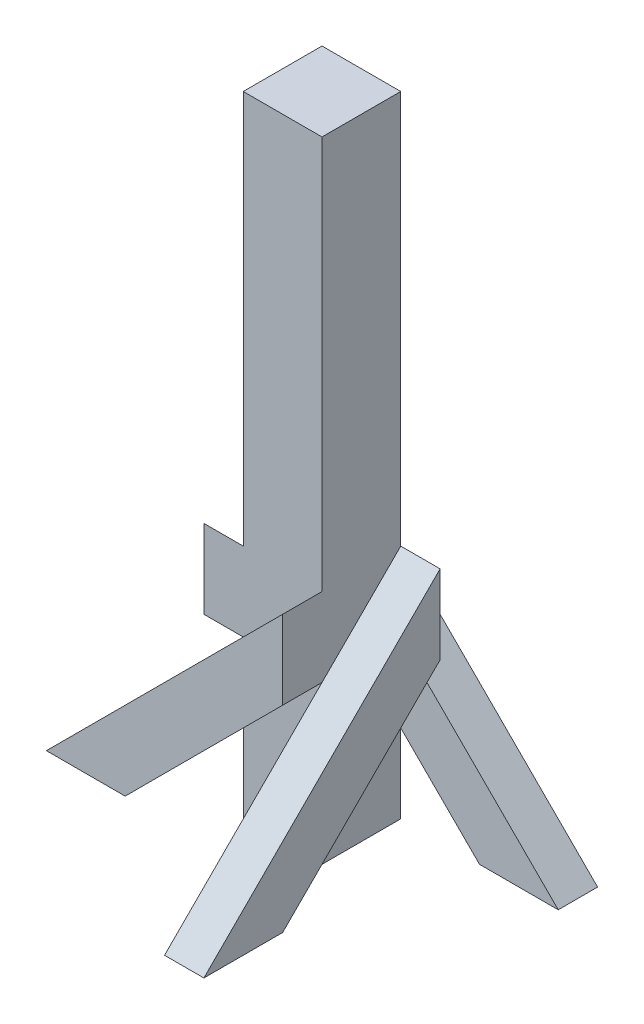
ISO-10303-21;
HEADER;
FILE_DESCRIPTION(('STEP AP214'),'2;1');
FILE_NAME('part.step','',(''),(''),'','','');
FILE_SCHEMA(('AUTOMOTIVE_DESIGN { 1 0 10303 214 1 1 1 1 }'));
ENDSEC;
DATA;
#1=APPLICATION_CONTEXT('core data for automotive mechanical design processes');
#2=APPLICATION_PROTOCOL_DEFINITION('international standard','automotive_design',2000,#1);
#3=PRODUCT_CONTEXT('',#1,'mechanical');
#4=PRODUCT('Part','Part','',(#3));
#5=PRODUCT_RELATED_PRODUCT_CATEGORY('part','',(#4));
#6=PRODUCT_DEFINITION_FORMATION('','',#4);
#7=PRODUCT_DEFINITION_CONTEXT('part definition',#1,'design');
#8=PRODUCT_DEFINITION('design','',#6,#7);
#9=PRODUCT_DEFINITION_SHAPE('','',#8);
#10=(LENGTH_UNIT() NAMED_UNIT(*) SI_UNIT(.MILLI.,.METRE.));
#11=(NAMED_UNIT(*) PLANE_ANGLE_UNIT() SI_UNIT($,.RADIAN.));
#12=(NAMED_UNIT(*) SI_UNIT($,.STERADIAN.) SOLID_ANGLE_UNIT());
#13=UNCERTAINTY_MEASURE_WITH_UNIT(LENGTH_MEASURE(1.E-05),#10,'distance_accuracy_value','');
#14=(GEOMETRIC_REPRESENTATION_CONTEXT(3) GLOBAL_UNCERTAINTY_ASSIGNED_CONTEXT((#13)) GLOBAL_UNIT_ASSIGNED_CONTEXT((#10,
#11,#12)) REPRESENTATION_CONTEXT('',''));
#15=CARTESIAN_POINT('',(0.,0.,0.));
#16=DIRECTION('',(0.,0.,1.));
#17=DIRECTION('',(1.,0.,0.));
#18=AXIS2_PLACEMENT_3D('',#15,#16,#17);
#19=CARTESIAN_POINT('',(43.6880000000002,812.8,-61.976));
#20=DIRECTION('',(1.,0.,0.));
#21=DIRECTION('',(0.,0.,-1.));
#22=AXIS2_PLACEMENT_3D('',#19,#20,#21);
#23=PLANE('',#22);
#24=DIRECTION('',(0.,-1.,0.));
#25=VECTOR('',#24,1.);
#26=CARTESIAN_POINT('',(43.6880000000002,812.8,-61.976));
#27=LINE('',#26,#25);
#28=CARTESIAN_POINT('',(43.6880000000002,203.2,-61.976));
#29=VERTEX_POINT('',#28);
#30=CARTESIAN_POINT('',(43.6880000000003,101.6,-61.976));
#31=VERTEX_POINT('',#30);
#32=EDGE_CURVE('E276',#29,#31,#27,.T.);
#33=ORIENTED_EDGE('',*,*,#32,.F.);
#34=DIRECTION('',(0.,0.707106781186548,-0.707106781186547));
#35=VECTOR('',#34,1.);
#36=CARTESIAN_POINT('',(43.6880000000002,0.,141.224));
#37=LINE('',#36,#35);
#38=CARTESIAN_POINT('',(43.6880000000002,101.6,39.6239999999999));
#39=VERTEX_POINT('',#38);
#40=EDGE_CURVE('E355',#39,#29,#37,.T.);
#41=ORIENTED_EDGE('',*,*,#40,.F.);
#42=DIRECTION('',(0.,-1.,0.));
#43=VECTOR('',#42,1.);
#44=CARTESIAN_POINT('',(43.6880000000002,812.8,39.624));
#45=LINE('',#44,#43);
#46=CARTESIAN_POINT('',(43.6880000000002,0.,39.624));
#47=VERTEX_POINT('',#46);
#48=EDGE_CURVE('E340',#39,#47,#45,.T.);
#49=ORIENTED_EDGE('',*,*,#48,.T.);
#50=DIRECTION('',(0.,0.,1.));
#51=VECTOR('',#50,1.);
#52=CARTESIAN_POINT('',(43.6880000000002,0.,-61.976));
#53=LINE('',#52,#51);
#54=CARTESIAN_POINT('',(43.6880000000002,0.,-61.976));
#55=VERTEX_POINT('',#54);
#56=EDGE_CURVE('E328',#55,#47,#53,.T.);
#57=ORIENTED_EDGE('',*,*,#56,.F.);
#58=DIRECTION('',(0.,-1.,0.));
#59=VECTOR('',#58,1.);
#60=CARTESIAN_POINT('',(43.6880000000002,812.8,-61.976));
#61=LINE('',#60,#59);
#62=EDGE_CURVE('E336',#31,#55,#61,.T.);
#63=ORIENTED_EDGE('',*,*,#62,.F.);
#64=EDGE_LOOP('',(#33,#41,#49,#57,#63));
#65=FACE_BOUND('',#64,.T.);
#66=ADVANCED_FACE('F34',(#65),#23,.T.);
#67=DIRECTION('',(0.,0.,-1.));
#68=VECTOR('',#67,1.);
#69=CARTESIAN_POINT('',(43.6880000000002,203.2,90.424));
#70=LINE('',#69,#68);
#71=CARTESIAN_POINT('',(43.6880000000002,203.2,90.424));
#72=VERTEX_POINT('',#71);
#73=CARTESIAN_POINT('',(43.6880000000002,203.2,39.624));
#74=VERTEX_POINT('',#73);
#75=EDGE_CURVE('E239',#72,#74,#70,.T.);
#76=ORIENTED_EDGE('',*,*,#75,.T.);
#77=DIRECTION('',(0.,-0.707106781186547,0.707106781186547));
#78=VECTOR('',#77,1.);
#79=CARTESIAN_POINT('',(43.6880000000002,0.,242.824));
#80=LINE('',#79,#78);
#81=CARTESIAN_POINT('',(43.6880000000002,304.8,-61.9760000000001));
#82=VERTEX_POINT('',#81);
#83=EDGE_CURVE('E207',#82,#74,#80,.T.);
#84=ORIENTED_EDGE('',*,*,#83,.F.);
#85=CARTESIAN_POINT('',(43.6880000000002,812.8,-61.976));
#86=VERTEX_POINT('',#85);
#87=EDGE_CURVE('E338',#86,#82,#61,.T.);
#88=ORIENTED_EDGE('',*,*,#87,.F.);
#89=DIRECTION('',(0.,0.,1.));
#90=VECTOR('',#89,1.);
#91=CARTESIAN_POINT('',(43.6880000000002,812.8,-61.976));
#92=LINE('',#91,#90);
#93=CARTESIAN_POINT('',(43.6880000000002,812.8,39.624));
#94=VERTEX_POINT('',#93);
#95=EDGE_CURVE('E316',#86,#94,#92,.T.);
#96=ORIENTED_EDGE('',*,*,#95,.T.);
#97=CARTESIAN_POINT('',(43.688,304.8,39.624));
#98=VERTEX_POINT('',#97);
#99=EDGE_CURVE('E341',#94,#98,#45,.T.);
#100=ORIENTED_EDGE('',*,*,#99,.T.);
#101=DIRECTION('',(0.,0.,-1.));
#102=VECTOR('',#101,1.);
#103=CARTESIAN_POINT('',(43.6880000000002,304.8,90.424));
#104=LINE('',#103,#102);
#105=CARTESIAN_POINT('',(43.6880000000002,304.8,90.424));
#106=VERTEX_POINT('',#105);
#107=EDGE_CURVE('E236',#106,#98,#104,.T.);
#108=ORIENTED_EDGE('',*,*,#107,.F.);
#109=DIRECTION('',(0.,1.,0.));
#110=VECTOR('',#109,1.);
#111=CARTESIAN_POINT('',(43.6880000000002,304.8,90.424));
#112=LINE('',#111,#110);
#113=EDGE_CURVE('E225',#72,#106,#112,.T.);
#114=ORIENTED_EDGE('',*,*,#113,.F.);
#115=EDGE_LOOP('',(#76,#84,#88,#96,#100,#108,#114));
#116=FACE_BOUND('',#115,.T.);
#117=ADVANCED_FACE('F396',(#116),#23,.T.);
#118=CARTESIAN_POINT('',(-57.9119999999998,812.8,39.624));
#119=DIRECTION('',(0.,0.,-1.));
#120=DIRECTION('',(-1.,0.,0.));
#121=AXIS2_PLACEMENT_3D('',#118,#119,#120);
#122=PLANE('',#121);
#123=DIRECTION('',(-0.707106781186547,-0.707106781186547,0.));
#124=VECTOR('',#123,1.);
#125=CARTESIAN_POINT('',(-261.112,0.,39.624));
#126=LINE('',#125,#124);
#127=CARTESIAN_POINT('',(-57.9119999999998,203.2,39.6240000000001));
#128=VERTEX_POINT('',#127);
#129=EDGE_CURVE('E223',#98,#128,#126,.T.);
#130=ORIENTED_EDGE('',*,*,#129,.F.);
#131=ORIENTED_EDGE('',*,*,#99,.F.);
#132=DIRECTION('',(1.,0.,0.));
#133=VECTOR('',#132,1.);
#134=CARTESIAN_POINT('',(-57.9119999999998,812.8,39.624));
#135=LINE('',#134,#133);
#136=CARTESIAN_POINT('',(-57.9119999999998,812.8,39.624));
#137=VERTEX_POINT('',#136);
#138=EDGE_CURVE('E313',#137,#94,#135,.T.);
#139=ORIENTED_EDGE('',*,*,#138,.F.);
#140=DIRECTION('',(0.,-1.,0.));
#141=VECTOR('',#140,1.);
#142=CARTESIAN_POINT('',(-57.9119999999998,812.8,39.624));
#143=LINE('',#142,#141);
#144=CARTESIAN_POINT('',(-57.9119999999998,304.799999999999,39.6239999999998));
#145=VERTEX_POINT('',#144);
#146=EDGE_CURVE('E38',#137,#145,#143,.T.);
#147=ORIENTED_EDGE('',*,*,#146,.T.);
#148=DIRECTION('',(1.,0.,0.));
#149=VECTOR('',#148,1.);
#150=CARTESIAN_POINT('',(-108.712,304.8,39.6240000000001));
#151=LINE('',#150,#149);
#152=CARTESIAN_POINT('',(-108.712,304.8,39.6240000000001));
#153=VERTEX_POINT('',#152);
#154=EDGE_CURVE('E300',#153,#145,#151,.T.);
#155=ORIENTED_EDGE('',*,*,#154,.F.);
#156=DIRECTION('',(0.,1.,0.));
#157=VECTOR('',#156,1.);
#158=CARTESIAN_POINT('',(-108.712,304.8,39.6240000000001));
#159=LINE('',#158,#157);
#160=CARTESIAN_POINT('',(-108.712,203.2,39.6240000000001));
#161=VERTEX_POINT('',#160);
#162=EDGE_CURVE('E285',#161,#153,#159,.T.);
#163=ORIENTED_EDGE('',*,*,#162,.F.);
#164=DIRECTION('',(1.,0.,0.));
#165=VECTOR('',#164,1.);
#166=CARTESIAN_POINT('',(-108.712,203.2,39.6240000000001));
#167=LINE('',#166,#165);
#168=EDGE_CURVE('E303',#161,#128,#167,.T.);
#169=ORIENTED_EDGE('',*,*,#168,.T.);
#170=EDGE_LOOP('',(#130,#131,#139,#147,#155,#163,#169));
#171=FACE_BOUND('',#170,.T.);
#172=ADVANCED_FACE('F426',(#171),#122,.F.);
#173=DIRECTION('',(0.707106781186547,0.707106781186547,0.));
#174=VECTOR('',#173,1.);
#175=CARTESIAN_POINT('',(-159.512,0.,39.624));
#176=LINE('',#175,#174);
#177=CARTESIAN_POINT('',(-57.9119999999999,101.6,39.624));
#178=VERTEX_POINT('',#177);
#179=EDGE_CURVE('E11',#178,#74,#176,.T.);
#180=ORIENTED_EDGE('',*,*,#179,.F.);
#181=CARTESIAN_POINT('',(-57.9119999999998,0.,39.624));
#182=VERTEX_POINT('',#181);
#183=EDGE_CURVE('E343',#178,#182,#143,.T.);
#184=ORIENTED_EDGE('',*,*,#183,.T.);
#185=DIRECTION('',(1.,0.,0.));
#186=VECTOR('',#185,1.);
#187=CARTESIAN_POINT('',(-57.9119999999998,0.,39.624));
#188=LINE('',#187,#186);
#189=EDGE_CURVE('E325',#182,#47,#188,.T.);
#190=ORIENTED_EDGE('',*,*,#189,.T.);
#191=ORIENTED_EDGE('',*,*,#48,.F.);
#192=EDGE_CURVE('E344',#74,#39,#45,.T.);
#193=ORIENTED_EDGE('',*,*,#192,.F.);
#194=EDGE_LOOP('',(#180,#184,#190,#191,#193));
#195=FACE_BOUND('',#194,.T.);
#196=ADVANCED_FACE('F357',(#195),#122,.F.);
#197=CARTESIAN_POINT('',(-57.9119999999998,812.8,-61.976));
#198=DIRECTION('',(0.,0.,-1.));
#199=DIRECTION('',(-1.,0.,0.));
#200=AXIS2_PLACEMENT_3D('',#197,#198,#199);
#201=PLANE('',#200);
#202=DIRECTION('',(0.,-1.,0.));
#203=VECTOR('',#202,1.);
#204=CARTESIAN_POINT('',(-57.9119999999998,812.8,-61.976));
#205=LINE('',#204,#203);
#206=CARTESIAN_POINT('',(-57.9119999999998,203.2,-61.976));
#207=VERTEX_POINT('',#206);
#208=CARTESIAN_POINT('',(-57.9119999999998,101.6,-61.9760000000001));
#209=VERTEX_POINT('',#208);
#210=EDGE_CURVE('E337',#207,#209,#205,.T.);
#211=ORIENTED_EDGE('',*,*,#210,.F.);
#212=DIRECTION('',(-0.707106781186547,0.707106781186548,0.));
#213=VECTOR('',#212,1.);
#214=CARTESIAN_POINT('',(145.288,0.,-61.976));
#215=LINE('',#214,#213);
#216=EDGE_CURVE('E259',#31,#207,#215,.T.);
#217=ORIENTED_EDGE('',*,*,#216,.F.);
#218=ORIENTED_EDGE('',*,*,#62,.T.);
#219=DIRECTION('',(1.,0.,0.));
#220=VECTOR('',#219,1.);
#221=CARTESIAN_POINT('',(-57.9119999999998,0.,-61.976));
#222=LINE('',#221,#220);
#223=CARTESIAN_POINT('',(-57.9119999999998,0.,-61.976));
#224=VERTEX_POINT('',#223);
#225=EDGE_CURVE('E314',#224,#55,#222,.T.);
#226=ORIENTED_EDGE('',*,*,#225,.F.);
#227=EDGE_CURVE('E322',#209,#224,#205,.T.);
#228=ORIENTED_EDGE('',*,*,#227,.F.);
#229=EDGE_LOOP('',(#211,#217,#218,#226,#228));
#230=FACE_BOUND('',#229,.T.);
#231=ADVANCED_FACE('F365',(#230),#201,.T.);
#232=ORIENTED_EDGE('',*,*,#87,.T.);
#233=DIRECTION('',(-1.,0.,0.));
#234=VECTOR('',#233,1.);
#235=CARTESIAN_POINT('',(94.4880000000002,304.8,-61.976));
#236=LINE('',#235,#234);
#237=CARTESIAN_POINT('',(94.4880000000002,304.8,-61.976));
#238=VERTEX_POINT('',#237);
#239=EDGE_CURVE('E52',#238,#82,#236,.T.);
#240=ORIENTED_EDGE('',*,*,#239,.F.);
#241=DIRECTION('',(0.,1.,0.));
#242=VECTOR('',#241,1.);
#243=CARTESIAN_POINT('',(94.4880000000002,304.8,-61.976));
#244=LINE('',#243,#242);
#245=CARTESIAN_POINT('',(94.4880000000002,203.2,-61.976));
#246=VERTEX_POINT('',#245);
#247=EDGE_CURVE('E198',#246,#238,#244,.T.);
#248=ORIENTED_EDGE('',*,*,#247,.F.);
#249=DIRECTION('',(-1.,0.,0.));
#250=VECTOR('',#249,1.);
#251=CARTESIAN_POINT('',(94.4880000000002,203.2,-61.976));
#252=LINE('',#251,#250);
#253=EDGE_CURVE('E195',#246,#29,#252,.T.);
#254=ORIENTED_EDGE('',*,*,#253,.T.);
#255=DIRECTION('',(0.707106781186547,-0.707106781186547,0.));
#256=VECTOR('',#255,1.);
#257=CARTESIAN_POINT('',(246.888,0.,-61.976));
#258=LINE('',#257,#256);
#259=CARTESIAN_POINT('',(-57.9119999999999,304.8,-61.976));
#260=VERTEX_POINT('',#259);
#261=EDGE_CURVE('E250',#260,#29,#258,.T.);
#262=ORIENTED_EDGE('',*,*,#261,.F.);
#263=CARTESIAN_POINT('',(-57.9119999999998,812.8,-61.976));
#264=VERTEX_POINT('',#263);
#265=EDGE_CURVE('E333',#264,#260,#205,.T.);
#266=ORIENTED_EDGE('',*,*,#265,.F.);
#267=DIRECTION('',(1.,0.,0.));
#268=VECTOR('',#267,1.);
#269=CARTESIAN_POINT('',(-57.9119999999998,812.8,-61.976));
#270=LINE('',#269,#268);
#271=EDGE_CURVE('E319',#264,#86,#270,.T.);
#272=ORIENTED_EDGE('',*,*,#271,.T.);
#273=EDGE_LOOP('',(#232,#240,#248,#254,#262,#266,#272));
#274=FACE_BOUND('',#273,.T.);
#275=ADVANCED_FACE('F386',(#274),#201,.T.);
#276=CARTESIAN_POINT('',(-57.9119999999998,812.8,-61.976));
#277=DIRECTION('',(1.,0.,0.));
#278=DIRECTION('',(0.,0.,-1.));
#279=AXIS2_PLACEMENT_3D('',#276,#277,#278);
#280=PLANE('',#279);
#281=DIRECTION('',(0.,-0.707106781186547,-0.707106781186547));
#282=VECTOR('',#281,1.);
#283=CARTESIAN_POINT('',(-57.9119999999998,0.,-265.176));
#284=LINE('',#283,#282);
#285=EDGE_CURVE('E283',#145,#207,#284,.T.);
#286=ORIENTED_EDGE('',*,*,#285,.F.);
#287=ORIENTED_EDGE('',*,*,#146,.F.);
#288=DIRECTION('',(0.,0.,1.));
#289=VECTOR('',#288,1.);
#290=CARTESIAN_POINT('',(-57.9119999999998,812.8,-61.976));
#291=LINE('',#290,#289);
#292=EDGE_CURVE('E310',#264,#137,#291,.T.);
#293=ORIENTED_EDGE('',*,*,#292,.F.);
#294=ORIENTED_EDGE('',*,*,#265,.T.);
#295=DIRECTION('',(0.,0.,1.));
#296=VECTOR('',#295,1.);
#297=CARTESIAN_POINT('',(-57.9119999999998,304.8,-112.776));
#298=LINE('',#297,#296);
#299=CARTESIAN_POINT('',(-57.9119999999998,304.8,-112.776));
#300=VERTEX_POINT('',#299);
#301=EDGE_CURVE('E268',#300,#260,#298,.T.);
#302=ORIENTED_EDGE('',*,*,#301,.F.);
#303=DIRECTION('',(0.,1.,0.));
#304=VECTOR('',#303,1.);
#305=CARTESIAN_POINT('',(-57.9119999999998,304.8,-112.776));
#306=LINE('',#305,#304);
#307=CARTESIAN_POINT('',(-57.9119999999998,203.2,-112.776));
#308=VERTEX_POINT('',#307);
#309=EDGE_CURVE('E252',#308,#300,#306,.T.);
#310=ORIENTED_EDGE('',*,*,#309,.F.);
#311=DIRECTION('',(0.,0.,1.));
#312=VECTOR('',#311,1.);
#313=CARTESIAN_POINT('',(-57.9119999999998,203.2,-112.776));
#314=LINE('',#313,#312);
#315=EDGE_CURVE('E270',#308,#207,#314,.T.);
#316=ORIENTED_EDGE('',*,*,#315,.T.);
#317=EDGE_LOOP('',(#286,#287,#293,#294,#302,#310,#316));
#318=FACE_BOUND('',#317,.T.);
#319=ADVANCED_FACE('F36',(#318),#280,.F.);
#320=DIRECTION('',(0.,0.707106781186547,0.707106781186547));
#321=VECTOR('',#320,1.);
#322=CARTESIAN_POINT('',(-57.9119999999998,0.,-163.576));
#323=LINE('',#322,#321);
#324=EDGE_CURVE('E43',#209,#128,#323,.T.);
#325=ORIENTED_EDGE('',*,*,#324,.F.);
#326=ORIENTED_EDGE('',*,*,#227,.T.);
#327=DIRECTION('',(0.,0.,1.));
#328=VECTOR('',#327,1.);
#329=CARTESIAN_POINT('',(-57.9119999999998,0.,-61.976));
#330=LINE('',#329,#328);
#331=EDGE_CURVE('E309',#224,#182,#330,.T.);
#332=ORIENTED_EDGE('',*,*,#331,.T.);
#333=ORIENTED_EDGE('',*,*,#183,.F.);
#334=EDGE_CURVE('E348',#128,#178,#143,.T.);
#335=ORIENTED_EDGE('',*,*,#334,.F.);
#336=EDGE_LOOP('',(#325,#326,#332,#333,#335));
#337=FACE_BOUND('',#336,.T.);
#338=ADVANCED_FACE('F439',(#337),#280,.F.);
#339=CARTESIAN_POINT('',(0.,812.8,0.));
#340=DIRECTION('',(0.,1.,0.));
#341=DIRECTION('',(0.,0.,1.));
#342=AXIS2_PLACEMENT_3D('',#339,#340,#341);
#343=PLANE('',#342);
#344=ORIENTED_EDGE('',*,*,#292,.T.);
#345=ORIENTED_EDGE('',*,*,#138,.T.);
#346=ORIENTED_EDGE('',*,*,#95,.F.);
#347=ORIENTED_EDGE('',*,*,#271,.F.);
#348=EDGE_LOOP('',(#344,#345,#346,#347));
#349=FACE_BOUND('',#348,.T.);
#350=ADVANCED_FACE('F395',(#349),#343,.T.);
#351=CARTESIAN_POINT('',(0.,0.,0.));
#352=DIRECTION('',(0.,1.,0.));
#353=DIRECTION('',(0.,0.,1.));
#354=AXIS2_PLACEMENT_3D('',#351,#352,#353);
#355=PLANE('',#354);
#356=ORIENTED_EDGE('',*,*,#331,.F.);
#357=ORIENTED_EDGE('',*,*,#225,.T.);
#358=ORIENTED_EDGE('',*,*,#56,.T.);
#359=ORIENTED_EDGE('',*,*,#189,.F.);
#360=EDGE_LOOP('',(#356,#357,#358,#359));
#361=FACE_BOUND('',#360,.T.);
#362=ADVANCED_FACE('F360',(#361),#355,.F.);
#363=CARTESIAN_POINT('',(-108.712,0.,-265.176));
#364=DIRECTION('',(0.,1.,0.));
#365=DIRECTION('',(0.,0.,1.));
#366=AXIS2_PLACEMENT_3D('',#363,#364,#365);
#367=PLANE('',#366);
#368=DIRECTION('',(0.,0.,1.));
#369=VECTOR('',#368,1.);
#370=CARTESIAN_POINT('',(-57.9119999999998,0.,-265.176));
#371=LINE('',#370,#369);
#372=CARTESIAN_POINT('',(-57.9119999999998,0.,-265.176));
#373=VERTEX_POINT('',#372);
#374=CARTESIAN_POINT('',(-57.9119999999998,0.,-163.576));
#375=VERTEX_POINT('',#374);
#376=EDGE_CURVE('E278',#373,#375,#371,.T.);
#377=ORIENTED_EDGE('',*,*,#376,.T.);
#378=DIRECTION('',(1.,0.,0.));
#379=VECTOR('',#378,1.);
#380=CARTESIAN_POINT('',(-108.712,0.,-163.576));
#381=LINE('',#380,#379);
#382=CARTESIAN_POINT('',(-108.712,0.,-163.576));
#383=VERTEX_POINT('',#382);
#384=EDGE_CURVE('E306',#383,#375,#381,.T.);
#385=ORIENTED_EDGE('',*,*,#384,.F.);
#386=DIRECTION('',(0.,0.,1.));
#387=VECTOR('',#386,1.);
#388=CARTESIAN_POINT('',(-108.712,0.,-265.176));
#389=LINE('',#388,#387);
#390=CARTESIAN_POINT('',(-108.712,0.,-265.176));
#391=VERTEX_POINT('',#390);
#392=EDGE_CURVE('E279',#391,#383,#389,.T.);
#393=ORIENTED_EDGE('',*,*,#392,.F.);
#394=DIRECTION('',(1.,0.,0.));
#395=VECTOR('',#394,1.);
#396=CARTESIAN_POINT('',(-108.712,0.,-265.176));
#397=LINE('',#396,#395);
#398=EDGE_CURVE('E289',#391,#373,#397,.T.);
#399=ORIENTED_EDGE('',*,*,#398,.T.);
#400=EDGE_LOOP('',(#377,#385,#393,#399));
#401=FACE_BOUND('',#400,.T.);
#402=ADVANCED_FACE('F435',(#401),#367,.F.);
#403=CARTESIAN_POINT('',(-108.712,0.,-163.576));
#404=DIRECTION('',(0.,0.707106781186548,-0.707106781186548));
#405=DIRECTION('',(0.,0.707106781186548,0.707106781186548));
#406=AXIS2_PLACEMENT_3D('',#403,#404,#405);
#407=PLANE('',#406);
#408=EDGE_CURVE('E292',#375,#209,#323,.T.);
#409=ORIENTED_EDGE('',*,*,#408,.T.);
#410=ORIENTED_EDGE('',*,*,#324,.T.);
#411=ORIENTED_EDGE('',*,*,#168,.F.);
#412=DIRECTION('',(0.,0.707106781186547,0.707106781186547));
#413=VECTOR('',#412,1.);
#414=CARTESIAN_POINT('',(-108.712,0.,-163.576));
#415=LINE('',#414,#413);
#416=EDGE_CURVE('E282',#383,#161,#415,.T.);
#417=ORIENTED_EDGE('',*,*,#416,.F.);
#418=ORIENTED_EDGE('',*,*,#384,.T.);
#419=EDGE_LOOP('',(#409,#410,#411,#417,#418));
#420=FACE_BOUND('',#419,.T.);
#421=ADVANCED_FACE('F424',(#420),#407,.F.);
#422=CARTESIAN_POINT('',(-108.712,0.,-265.176));
#423=DIRECTION('',(0.,-0.707106781186548,0.707106781186548));
#424=DIRECTION('',(0.,-0.707106781186548,-0.707106781186547));
#425=AXIS2_PLACEMENT_3D('',#422,#423,#424);
#426=PLANE('',#425);
#427=ORIENTED_EDGE('',*,*,#285,.T.);
#428=EDGE_CURVE('E295',#207,#373,#284,.T.);
#429=ORIENTED_EDGE('',*,*,#428,.T.);
#430=ORIENTED_EDGE('',*,*,#398,.F.);
#431=DIRECTION('',(0.,-0.707106781186547,-0.707106781186547));
#432=VECTOR('',#431,1.);
#433=CARTESIAN_POINT('',(-108.712,0.,-265.176));
#434=LINE('',#433,#432);
#435=EDGE_CURVE('E287',#153,#391,#434,.T.);
#436=ORIENTED_EDGE('',*,*,#435,.F.);
#437=ORIENTED_EDGE('',*,*,#154,.T.);
#438=EDGE_LOOP('',(#427,#429,#430,#436,#437));
#439=FACE_BOUND('',#438,.T.);
#440=ADVANCED_FACE('F480',(#439),#426,.F.);
#441=CARTESIAN_POINT('',(-108.712,0.,0.));
#442=DIRECTION('',(1.,0.,0.));
#443=DIRECTION('',(0.,0.,-1.));
#444=AXIS2_PLACEMENT_3D('',#441,#442,#443);
#445=PLANE('',#444);
#446=ORIENTED_EDGE('',*,*,#392,.T.);
#447=ORIENTED_EDGE('',*,*,#416,.T.);
#448=ORIENTED_EDGE('',*,*,#162,.T.);
#449=ORIENTED_EDGE('',*,*,#435,.T.);
#450=EDGE_LOOP('',(#446,#447,#448,#449));
#451=FACE_BOUND('',#450,.T.);
#452=ADVANCED_FACE('F429',(#451),#445,.F.);
#453=CARTESIAN_POINT('',(-57.9119999999998,0.,0.));
#454=DIRECTION('',(1.,0.,0.));
#455=DIRECTION('',(0.,0.,-1.));
#456=AXIS2_PLACEMENT_3D('',#453,#454,#455);
#457=PLANE('',#456);
#458=ORIENTED_EDGE('',*,*,#428,.F.);
#459=ORIENTED_EDGE('',*,*,#210,.T.);
#460=ORIENTED_EDGE('',*,*,#408,.F.);
#461=ORIENTED_EDGE('',*,*,#376,.F.);
#462=EDGE_LOOP('',(#458,#459,#460,#461));
#463=FACE_BOUND('',#462,.T.);
#464=ADVANCED_FACE('F438',(#463),#457,.T.);
#465=CARTESIAN_POINT('',(246.888,0.,-112.776));
#466=DIRECTION('',(0.,1.,0.));
#467=DIRECTION('',(-1.,0.,0.));
#468=AXIS2_PLACEMENT_3D('',#465,#466,#467);
#469=PLANE('',#468);
#470=DIRECTION('',(-1.,0.,0.));
#471=VECTOR('',#470,1.);
#472=CARTESIAN_POINT('',(246.888,0.,-61.976));
#473=LINE('',#472,#471);
#474=CARTESIAN_POINT('',(246.888,0.,-61.976));
#475=VERTEX_POINT('',#474);
#476=CARTESIAN_POINT('',(145.288,0.,-61.976));
#477=VERTEX_POINT('',#476);
#478=EDGE_CURVE('E245',#475,#477,#473,.T.);
#479=ORIENTED_EDGE('',*,*,#478,.T.);
#480=DIRECTION('',(0.,0.,1.));
#481=VECTOR('',#480,1.);
#482=CARTESIAN_POINT('',(145.288,0.,-112.776));
#483=LINE('',#482,#481);
#484=CARTESIAN_POINT('',(145.288,0.,-112.776));
#485=VERTEX_POINT('',#484);
#486=EDGE_CURVE('E273',#485,#477,#483,.T.);
#487=ORIENTED_EDGE('',*,*,#486,.F.);
#488=DIRECTION('',(-1.,0.,0.));
#489=VECTOR('',#488,1.);
#490=CARTESIAN_POINT('',(246.888,0.,-112.776));
#491=LINE('',#490,#489);
#492=CARTESIAN_POINT('',(246.888,0.,-112.776));
#493=VERTEX_POINT('',#492);
#494=EDGE_CURVE('E246',#493,#485,#491,.T.);
#495=ORIENTED_EDGE('',*,*,#494,.F.);
#496=DIRECTION('',(0.,0.,1.));
#497=VECTOR('',#496,1.);
#498=CARTESIAN_POINT('',(246.888,0.,-112.776));
#499=LINE('',#498,#497);
#500=EDGE_CURVE('E256',#493,#475,#499,.T.);
#501=ORIENTED_EDGE('',*,*,#500,.T.);
#502=EDGE_LOOP('',(#479,#487,#495,#501));
#503=FACE_BOUND('',#502,.T.);
#504=ADVANCED_FACE('F378',(#503),#469,.F.);
#505=CARTESIAN_POINT('',(145.288,0.,-112.776));
#506=DIRECTION('',(0.707106781186548,0.707106781186547,0.));
#507=DIRECTION('',(-0.707106781186547,0.707106781186548,0.));
#508=AXIS2_PLACEMENT_3D('',#505,#506,#507);
#509=PLANE('',#508);
#510=EDGE_CURVE('E260',#477,#31,#215,.T.);
#511=ORIENTED_EDGE('',*,*,#510,.T.);
#512=ORIENTED_EDGE('',*,*,#216,.T.);
#513=ORIENTED_EDGE('',*,*,#315,.F.);
#514=DIRECTION('',(-0.707106781186547,0.707106781186548,0.));
#515=VECTOR('',#514,1.);
#516=CARTESIAN_POINT('',(145.288,0.,-112.776));
#517=LINE('',#516,#515);
#518=EDGE_CURVE('E249',#485,#308,#517,.T.);
#519=ORIENTED_EDGE('',*,*,#518,.F.);
#520=ORIENTED_EDGE('',*,*,#486,.T.);
#521=EDGE_LOOP('',(#511,#512,#513,#519,#520));
#522=FACE_BOUND('',#521,.T.);
#523=ADVANCED_FACE('F373',(#522),#509,.F.);
#524=CARTESIAN_POINT('',(246.888,0.,-112.776));
#525=DIRECTION('',(-0.707106781186548,-0.707106781186548,0.));
#526=DIRECTION('',(0.707106781186547,-0.707106781186548,0.));
#527=AXIS2_PLACEMENT_3D('',#524,#525,#526);
#528=PLANE('',#527);
#529=ORIENTED_EDGE('',*,*,#261,.T.);
#530=EDGE_CURVE('E263',#29,#475,#258,.T.);
#531=ORIENTED_EDGE('',*,*,#530,.T.);
#532=ORIENTED_EDGE('',*,*,#500,.F.);
#533=DIRECTION('',(0.707106781186547,-0.707106781186547,0.));
#534=VECTOR('',#533,1.);
#535=CARTESIAN_POINT('',(246.888,0.,-112.776));
#536=LINE('',#535,#534);
#537=EDGE_CURVE('E254',#300,#493,#536,.T.);
#538=ORIENTED_EDGE('',*,*,#537,.F.);
#539=ORIENTED_EDGE('',*,*,#301,.T.);
#540=EDGE_LOOP('',(#529,#531,#532,#538,#539));
#541=FACE_BOUND('',#540,.T.);
#542=ADVANCED_FACE('F382',(#541),#528,.F.);
#543=CARTESIAN_POINT('',(0.,0.,-112.776));
#544=DIRECTION('',(0.,0.,1.));
#545=DIRECTION('',(1.,0.,0.));
#546=AXIS2_PLACEMENT_3D('',#543,#544,#545);
#547=PLANE('',#546);
#548=ORIENTED_EDGE('',*,*,#494,.T.);
#549=ORIENTED_EDGE('',*,*,#518,.T.);
#550=ORIENTED_EDGE('',*,*,#309,.T.);
#551=ORIENTED_EDGE('',*,*,#537,.T.);
#552=EDGE_LOOP('',(#548,#549,#550,#551));
#553=FACE_BOUND('',#552,.T.);
#554=ADVANCED_FACE('F520',(#553),#547,.F.);
#555=CARTESIAN_POINT('',(0.,0.,-61.976));
#556=DIRECTION('',(0.,0.,1.));
#557=DIRECTION('',(1.,0.,0.));
#558=AXIS2_PLACEMENT_3D('',#555,#556,#557);
#559=PLANE('',#558);
#560=ORIENTED_EDGE('',*,*,#530,.F.);
#561=ORIENTED_EDGE('',*,*,#32,.T.);
#562=ORIENTED_EDGE('',*,*,#510,.F.);
#563=ORIENTED_EDGE('',*,*,#478,.F.);
#564=EDGE_LOOP('',(#560,#561,#562,#563));
#565=FACE_BOUND('',#564,.T.);
#566=ADVANCED_FACE('F370',(#565),#559,.T.);
#567=CARTESIAN_POINT('',(-261.112,0.,90.424));
#568=DIRECTION('',(0.,1.,0.));
#569=DIRECTION('',(-1.,0.,0.));
#570=AXIS2_PLACEMENT_3D('',#567,#568,#569);
#571=PLANE('',#570);
#572=DIRECTION('',(1.,0.,0.));
#573=VECTOR('',#572,1.);
#574=CARTESIAN_POINT('',(-261.112,0.,39.624));
#575=LINE('',#574,#573);
#576=CARTESIAN_POINT('',(-261.112,0.,39.624));
#577=VERTEX_POINT('',#576);
#578=CARTESIAN_POINT('',(-159.512,0.,39.624));
#579=VERTEX_POINT('',#578);
#580=EDGE_CURVE('E212',#577,#579,#575,.T.);
#581=ORIENTED_EDGE('',*,*,#580,.T.);
#582=DIRECTION('',(0.,0.,-1.));
#583=VECTOR('',#582,1.);
#584=CARTESIAN_POINT('',(-159.512,0.,90.424));
#585=LINE('',#584,#583);
#586=CARTESIAN_POINT('',(-159.512,0.,90.424));
#587=VERTEX_POINT('',#586);
#588=EDGE_CURVE('E242',#587,#579,#585,.T.);
#589=ORIENTED_EDGE('',*,*,#588,.F.);
#590=DIRECTION('',(1.,0.,0.));
#591=VECTOR('',#590,1.);
#592=CARTESIAN_POINT('',(-261.112,0.,90.424));
#593=LINE('',#592,#591);
#594=CARTESIAN_POINT('',(-261.112,0.,90.424));
#595=VERTEX_POINT('',#594);
#596=EDGE_CURVE('E219',#595,#587,#593,.T.);
#597=ORIENTED_EDGE('',*,*,#596,.F.);
#598=DIRECTION('',(0.,0.,-1.));
#599=VECTOR('',#598,1.);
#600=CARTESIAN_POINT('',(-261.112,0.,90.424));
#601=LINE('',#600,#599);
#602=EDGE_CURVE('E228',#595,#577,#601,.T.);
#603=ORIENTED_EDGE('',*,*,#602,.T.);
#604=EDGE_LOOP('',(#581,#589,#597,#603));
#605=FACE_BOUND('',#604,.T.);
#606=ADVANCED_FACE('F551',(#605),#571,.F.);
#607=CARTESIAN_POINT('',(-159.512,0.,90.424));
#608=DIRECTION('',(-0.707106781186548,0.707106781186548,0.));
#609=DIRECTION('',(-0.707106781186548,-0.707106781186548,0.));
#610=AXIS2_PLACEMENT_3D('',#607,#608,#609);
#611=PLANE('',#610);
#612=EDGE_CURVE('E45',#579,#178,#176,.T.);
#613=ORIENTED_EDGE('',*,*,#612,.T.);
#614=ORIENTED_EDGE('',*,*,#179,.T.);
#615=ORIENTED_EDGE('',*,*,#75,.F.);
#616=DIRECTION('',(0.707106781186547,0.707106781186547,0.));
#617=VECTOR('',#616,1.);
#618=CARTESIAN_POINT('',(-159.512,0.,90.424));
#619=LINE('',#618,#617);
#620=EDGE_CURVE('E222',#587,#72,#619,.T.);
#621=ORIENTED_EDGE('',*,*,#620,.F.);
#622=ORIENTED_EDGE('',*,*,#588,.T.);
#623=EDGE_LOOP('',(#613,#614,#615,#621,#622));
#624=FACE_BOUND('',#623,.T.);
#625=ADVANCED_FACE('F411',(#624),#611,.F.);
#626=CARTESIAN_POINT('',(-261.112,0.,90.424));
#627=DIRECTION('',(0.707106781186548,-0.707106781186548,0.));
#628=DIRECTION('',(0.707106781186547,0.707106781186548,0.));
#629=AXIS2_PLACEMENT_3D('',#626,#627,#628);
#630=PLANE('',#629);
#631=ORIENTED_EDGE('',*,*,#129,.T.);
#632=EDGE_CURVE('E231',#128,#577,#126,.T.);
#633=ORIENTED_EDGE('',*,*,#632,.T.);
#634=ORIENTED_EDGE('',*,*,#602,.F.);
#635=DIRECTION('',(-0.707106781186547,-0.707106781186547,0.));
#636=VECTOR('',#635,1.);
#637=CARTESIAN_POINT('',(-261.112,0.,90.424));
#638=LINE('',#637,#636);
#639=EDGE_CURVE('E227',#106,#595,#638,.T.);
#640=ORIENTED_EDGE('',*,*,#639,.F.);
#641=ORIENTED_EDGE('',*,*,#107,.T.);
#642=EDGE_LOOP('',(#631,#633,#634,#640,#641));
#643=FACE_BOUND('',#642,.T.);
#644=ADVANCED_FACE('F562',(#643),#630,.F.);
#645=CARTESIAN_POINT('',(0.,0.,90.424));
#646=DIRECTION('',(0.,0.,-1.));
#647=DIRECTION('',(-1.,0.,0.));
#648=AXIS2_PLACEMENT_3D('',#645,#646,#647);
#649=PLANE('',#648);
#650=ORIENTED_EDGE('',*,*,#596,.T.);
#651=ORIENTED_EDGE('',*,*,#620,.T.);
#652=ORIENTED_EDGE('',*,*,#113,.T.);
#653=ORIENTED_EDGE('',*,*,#639,.T.);
#654=EDGE_LOOP('',(#650,#651,#652,#653));
#655=FACE_BOUND('',#654,.T.);
#656=ADVANCED_FACE('F567',(#655),#649,.F.);
#657=CARTESIAN_POINT('',(0.,0.,39.624));
#658=DIRECTION('',(0.,0.,-1.));
#659=DIRECTION('',(-1.,0.,0.));
#660=AXIS2_PLACEMENT_3D('',#657,#658,#659);
#661=PLANE('',#660);
#662=ORIENTED_EDGE('',*,*,#632,.F.);
#663=ORIENTED_EDGE('',*,*,#334,.T.);
#664=ORIENTED_EDGE('',*,*,#612,.F.);
#665=ORIENTED_EDGE('',*,*,#580,.F.);
#666=EDGE_LOOP('',(#662,#663,#664,#665));
#667=FACE_BOUND('',#666,.T.);
#668=ADVANCED_FACE('F417',(#667),#661,.T.);
#669=CARTESIAN_POINT('',(43.6880000000002,0.,0.));
#670=DIRECTION('',(-1.,0.,0.));
#671=DIRECTION('',(0.,0.,1.));
#672=AXIS2_PLACEMENT_3D('',#669,#670,#671);
#673=PLANE('',#672);
#674=ORIENTED_EDGE('',*,*,#192,.T.);
#675=CARTESIAN_POINT('',(43.6880000000002,0.,141.224));
#676=VERTEX_POINT('',#675);
#677=EDGE_CURVE('E401',#676,#39,#37,.T.);
#678=ORIENTED_EDGE('',*,*,#677,.F.);
#679=DIRECTION('',(0.,0.,-1.));
#680=VECTOR('',#679,1.);
#681=CARTESIAN_POINT('',(43.6880000000002,0.,242.824));
#682=LINE('',#681,#680);
#683=CARTESIAN_POINT('',(43.6880000000002,0.,242.824));
#684=VERTEX_POINT('',#683);
#685=EDGE_CURVE('E211',#684,#676,#682,.T.);
#686=ORIENTED_EDGE('',*,*,#685,.F.);
#687=EDGE_CURVE('E399',#74,#684,#80,.T.);
#688=ORIENTED_EDGE('',*,*,#687,.F.);
#689=EDGE_LOOP('',(#674,#678,#686,#688));
#690=FACE_BOUND('',#689,.T.);
#691=ADVANCED_FACE('F409',(#690),#673,.T.);
#692=CARTESIAN_POINT('',(94.4880000000002,0.,242.824));
#693=DIRECTION('',(0.,1.,0.));
#694=DIRECTION('',(0.,0.,1.));
#695=AXIS2_PLACEMENT_3D('',#692,#693,#694);
#696=PLANE('',#695);
#697=ORIENTED_EDGE('',*,*,#685,.T.);
#698=DIRECTION('',(-1.,0.,0.));
#699=VECTOR('',#698,1.);
#700=CARTESIAN_POINT('',(94.4880000000002,0.,141.224));
#701=LINE('',#700,#699);
#702=CARTESIAN_POINT('',(94.4880000000002,0.,141.224));
#703=VERTEX_POINT('',#702);
#704=EDGE_CURVE('E192',#703,#676,#701,.T.);
#705=ORIENTED_EDGE('',*,*,#704,.F.);
#706=DIRECTION('',(0.,0.,-1.));
#707=VECTOR('',#706,1.);
#708=CARTESIAN_POINT('',(94.4880000000002,0.,242.824));
#709=LINE('',#708,#707);
#710=CARTESIAN_POINT('',(94.4880000000002,0.,242.824));
#711=VERTEX_POINT('',#710);
#712=EDGE_CURVE('E199',#711,#703,#709,.T.);
#713=ORIENTED_EDGE('',*,*,#712,.F.);
#714=DIRECTION('',(-1.,0.,0.));
#715=VECTOR('',#714,1.);
#716=CARTESIAN_POINT('',(94.4880000000002,0.,242.824));
#717=LINE('',#716,#715);
#718=EDGE_CURVE('E405',#711,#684,#717,.T.);
#719=ORIENTED_EDGE('',*,*,#718,.T.);
#720=EDGE_LOOP('',(#697,#705,#713,#719));
#721=FACE_BOUND('',#720,.T.);
#722=ADVANCED_FACE('F209',(#721),#696,.F.);
#723=CARTESIAN_POINT('',(94.4880000000002,0.,141.224));
#724=DIRECTION('',(0.,0.707106781186547,0.707106781186548));
#725=DIRECTION('',(0.,-0.707106781186548,0.707106781186547));
#726=AXIS2_PLACEMENT_3D('',#723,#724,#725);
#727=PLANE('',#726);
#728=ORIENTED_EDGE('',*,*,#677,.T.);
#729=ORIENTED_EDGE('',*,*,#40,.T.);
#730=ORIENTED_EDGE('',*,*,#253,.F.);
#731=DIRECTION('',(0.,0.707106781186548,-0.707106781186547));
#732=VECTOR('',#731,1.);
#733=CARTESIAN_POINT('',(94.4880000000002,0.,141.224));
#734=LINE('',#733,#732);
#735=EDGE_CURVE('E187',#703,#246,#734,.T.);
#736=ORIENTED_EDGE('',*,*,#735,.F.);
#737=ORIENTED_EDGE('',*,*,#704,.T.);
#738=EDGE_LOOP('',(#728,#729,#730,#736,#737));
#739=FACE_BOUND('',#738,.T.);
#740=ADVANCED_FACE('F190',(#739),#727,.F.);
#741=CARTESIAN_POINT('',(94.4880000000002,0.,242.824));
#742=DIRECTION('',(0.,-0.707106781186548,-0.707106781186548));
#743=DIRECTION('',(0.,0.707106781186548,-0.707106781186547));
#744=AXIS2_PLACEMENT_3D('',#741,#742,#743);
#745=PLANE('',#744);
#746=ORIENTED_EDGE('',*,*,#83,.T.);
#747=ORIENTED_EDGE('',*,*,#687,.T.);
#748=ORIENTED_EDGE('',*,*,#718,.F.);
#749=DIRECTION('',(0.,-0.707106781186547,0.707106781186547));
#750=VECTOR('',#749,1.);
#751=CARTESIAN_POINT('',(94.4880000000002,0.,242.824));
#752=LINE('',#751,#750);
#753=EDGE_CURVE('E203',#238,#711,#752,.T.);
#754=ORIENTED_EDGE('',*,*,#753,.F.);
#755=ORIENTED_EDGE('',*,*,#239,.T.);
#756=EDGE_LOOP('',(#746,#747,#748,#754,#755));
#757=FACE_BOUND('',#756,.T.);
#758=ADVANCED_FACE('F644',(#757),#745,.F.);
#759=CARTESIAN_POINT('',(94.4880000000002,0.,0.));
#760=DIRECTION('',(-1.,0.,0.));
#761=DIRECTION('',(0.,0.,1.));
#762=AXIS2_PLACEMENT_3D('',#759,#760,#761);
#763=PLANE('',#762);
#764=ORIENTED_EDGE('',*,*,#712,.T.);
#765=ORIENTED_EDGE('',*,*,#735,.T.);
#766=ORIENTED_EDGE('',*,*,#247,.T.);
#767=ORIENTED_EDGE('',*,*,#753,.T.);
#768=EDGE_LOOP('',(#764,#765,#766,#767));
#769=FACE_BOUND('',#768,.T.);
#770=ADVANCED_FACE('F202',(#769),#763,.F.);
#771=CLOSED_SHELL('',(#66,#117,#172,#196,#231,#275,#319,#338,#350,#362,#402,#421,#440,#452,#464,
#504,#523,#542,#554,#566,#606,#625,#644,#656,#668,#691,#722,#740,#758,#770));
#772=MANIFOLD_SOLID_BREP('B2',#771);
#773=ADVANCED_BREP_SHAPE_REPRESENTATION('',(#18,#772),#14);
#774=SHAPE_DEFINITION_REPRESENTATION(#9,#773);
ENDSEC;
END-ISO-10303-21;
